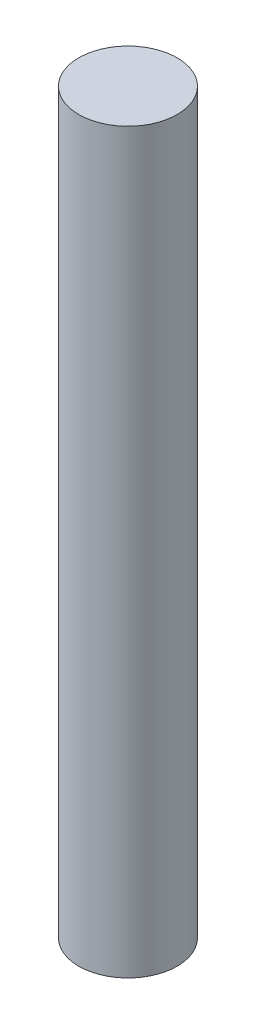
ISO-10303-21;
HEADER;
FILE_DESCRIPTION(('STEP AP214'),'2;1');
FILE_NAME('part.step','',(''),(''),'','','');
FILE_SCHEMA(('AUTOMOTIVE_DESIGN { 1 0 10303 214 1 1 1 1 }'));
ENDSEC;
DATA;
#1=APPLICATION_CONTEXT('core data for automotive mechanical design processes');
#2=APPLICATION_PROTOCOL_DEFINITION('international standard','automotive_design',2000,#1);
#3=PRODUCT_CONTEXT('',#1,'mechanical');
#4=PRODUCT('Part','Part','',(#3));
#5=PRODUCT_RELATED_PRODUCT_CATEGORY('part','',(#4));
#6=PRODUCT_DEFINITION_FORMATION('','',#4);
#7=PRODUCT_DEFINITION_CONTEXT('part definition',#1,'design');
#8=PRODUCT_DEFINITION('design','',#6,#7);
#9=PRODUCT_DEFINITION_SHAPE('','',#8);
#10=(LENGTH_UNIT() NAMED_UNIT(*) SI_UNIT(.MILLI.,.METRE.));
#11=(NAMED_UNIT(*) PLANE_ANGLE_UNIT() SI_UNIT($,.RADIAN.));
#12=(NAMED_UNIT(*) SI_UNIT($,.STERADIAN.) SOLID_ANGLE_UNIT());
#13=UNCERTAINTY_MEASURE_WITH_UNIT(LENGTH_MEASURE(1.E-05),#10,'distance_accuracy_value','');
#14=(GEOMETRIC_REPRESENTATION_CONTEXT(3) GLOBAL_UNCERTAINTY_ASSIGNED_CONTEXT((#13)) GLOBAL_UNIT_ASSIGNED_CONTEXT((#10,
#11,#12)) REPRESENTATION_CONTEXT('',''));
#15=CARTESIAN_POINT('',(0.,0.,0.));
#16=DIRECTION('',(0.,0.,1.));
#17=DIRECTION('',(1.,0.,0.));
#18=AXIS2_PLACEMENT_3D('',#15,#16,#17);
#19=CARTESIAN_POINT('',(0.,95.25,0.));
#20=DIRECTION('',(0.,-1.,0.));
#21=DIRECTION('',(0.,0.,-1.));
#22=AXIS2_PLACEMENT_3D('',#19,#20,#21);
#23=CYLINDRICAL_SURFACE('',#22,6.35);
#24=CARTESIAN_POINT('',(0.,95.25,0.));
#25=DIRECTION('',(0.,1.,0.));
#26=DIRECTION('',(0.,0.,1.));
#27=AXIS2_PLACEMENT_3D('',#24,#25,#26);
#28=CIRCLE('',#27,6.35);
#29=CARTESIAN_POINT('',(0.,95.25,6.35));
#30=VERTEX_POINT('',#29);
#31=EDGE_CURVE('E10',#30,#30,#28,.T.);
#32=ORIENTED_EDGE('',*,*,#31,.F.);
#33=EDGE_LOOP('',(#32));
#34=FACE_BOUND('',#33,.T.);
#35=CARTESIAN_POINT('',(0.,0.,0.));
#36=DIRECTION('',(0.,1.,0.));
#37=DIRECTION('',(0.,0.,1.));
#38=AXIS2_PLACEMENT_3D('',#35,#36,#37);
#39=CIRCLE('',#38,6.35);
#40=CARTESIAN_POINT('',(0.,0.,6.35));
#41=VERTEX_POINT('',#40);
#42=EDGE_CURVE('E33',#41,#41,#39,.T.);
#43=ORIENTED_EDGE('',*,*,#42,.T.);
#44=EDGE_LOOP('',(#43));
#45=FACE_BOUND('',#44,.T.);
#46=ADVANCED_FACE('F30',(#34,#45),#23,.T.);
#47=CARTESIAN_POINT('',(0.,95.25,0.));
#48=DIRECTION('',(0.,1.,0.));
#49=DIRECTION('',(0.,0.,1.));
#50=AXIS2_PLACEMENT_3D('',#47,#48,#49);
#51=PLANE('',#50);
#52=ORIENTED_EDGE('',*,*,#31,.T.);
#53=EDGE_LOOP('',(#52));
#54=FACE_BOUND('',#53,.T.);
#55=ADVANCED_FACE('F45',(#54),#51,.T.);
#56=CARTESIAN_POINT('',(0.,0.,0.));
#57=DIRECTION('',(0.,1.,0.));
#58=DIRECTION('',(0.,0.,1.));
#59=AXIS2_PLACEMENT_3D('',#56,#57,#58);
#60=PLANE('',#59);
#61=ORIENTED_EDGE('',*,*,#42,.F.);
#62=EDGE_LOOP('',(#61));
#63=FACE_BOUND('',#62,.T.);
#64=ADVANCED_FACE('F43',(#63),#60,.F.);
#65=CLOSED_SHELL('',(#46,#55,#64));
#66=MANIFOLD_SOLID_BREP('B2',#65);
#67=ADVANCED_BREP_SHAPE_REPRESENTATION('',(#18,#66),#14);
#68=SHAPE_DEFINITION_REPRESENTATION(#9,#67);
ENDSEC;
END-ISO-10303-21;
